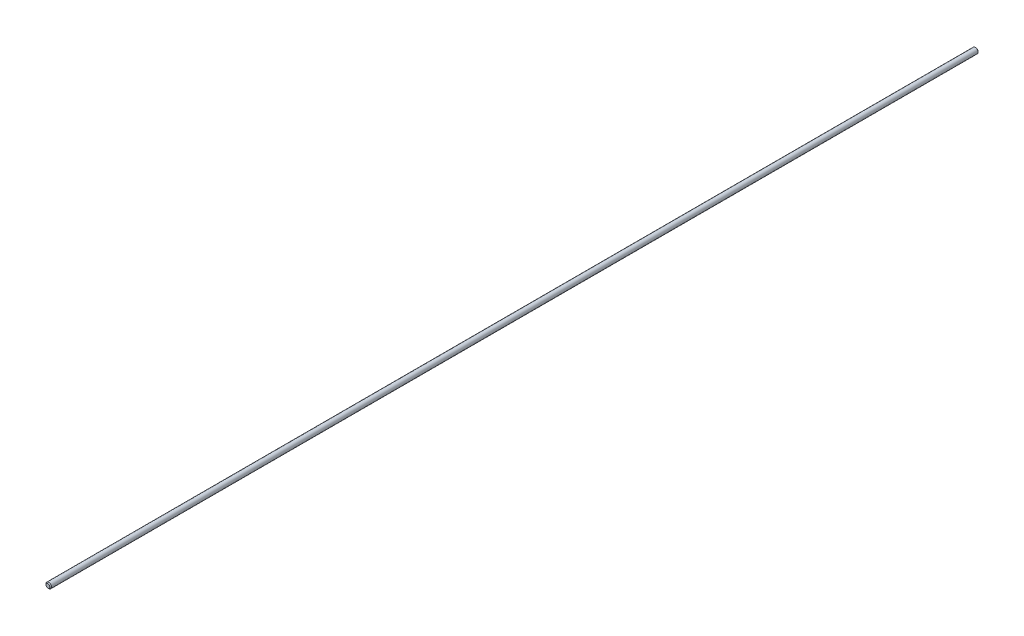
ISO-10303-21;
HEADER;
FILE_DESCRIPTION(('STEP AP214'),'2;1');
FILE_NAME('part.step','',(''),(''),'','','');
FILE_SCHEMA(('AUTOMOTIVE_DESIGN { 1 0 10303 214 1 1 1 1 }'));
ENDSEC;
DATA;
#1=APPLICATION_CONTEXT('core data for automotive mechanical design processes');
#2=APPLICATION_PROTOCOL_DEFINITION('international standard','automotive_design',2000,#1);
#3=PRODUCT_CONTEXT('',#1,'mechanical');
#4=PRODUCT('Part','Part','',(#3));
#5=PRODUCT_RELATED_PRODUCT_CATEGORY('part','',(#4));
#6=PRODUCT_DEFINITION_FORMATION('','',#4);
#7=PRODUCT_DEFINITION_CONTEXT('part definition',#1,'design');
#8=PRODUCT_DEFINITION('design','',#6,#7);
#9=PRODUCT_DEFINITION_SHAPE('','',#8);
#10=(LENGTH_UNIT() NAMED_UNIT(*) SI_UNIT(.MILLI.,.METRE.));
#11=(NAMED_UNIT(*) PLANE_ANGLE_UNIT() SI_UNIT($,.RADIAN.));
#12=(NAMED_UNIT(*) SI_UNIT($,.STERADIAN.) SOLID_ANGLE_UNIT());
#13=UNCERTAINTY_MEASURE_WITH_UNIT(LENGTH_MEASURE(1.E-05),#10,'distance_accuracy_value','');
#14=(GEOMETRIC_REPRESENTATION_CONTEXT(3) GLOBAL_UNCERTAINTY_ASSIGNED_CONTEXT((#13)) GLOBAL_UNIT_ASSIGNED_CONTEXT((#10,
#11,#12)) REPRESENTATION_CONTEXT('',''));
#15=CARTESIAN_POINT('',(0.,0.,0.));
#16=DIRECTION('',(0.,0.,1.));
#17=DIRECTION('',(1.,0.,0.));
#18=AXIS2_PLACEMENT_3D('',#15,#16,#17);
#19=CARTESIAN_POINT('',(0.,0.,267.3477));
#20=DIRECTION('',(0.,0.,1.));
#21=DIRECTION('',(1.,0.,0.));
#22=AXIS2_PLACEMENT_3D('',#19,#20,#21);
#23=CYLINDRICAL_SURFACE('',#22,1.58750000000226);
#24=CARTESIAN_POINT('',(0.,0.,-266.87145));
#25=DIRECTION('',(0.,0.,1.));
#26=DIRECTION('',(1.,0.,0.));
#27=AXIS2_PLACEMENT_3D('',#24,#25,#26);
#28=CIRCLE('',#27,1.58750000000226);
#29=CARTESIAN_POINT('',(1.58750000000226,0.,-266.87145));
#30=VERTEX_POINT('',#29);
#31=EDGE_CURVE('E42',#30,#30,#28,.T.);
#32=ORIENTED_EDGE('',*,*,#31,.T.);
#33=EDGE_LOOP('',(#32));
#34=FACE_BOUND('',#33,.T.);
#35=CARTESIAN_POINT('',(0.,0.,266.87145));
#36=DIRECTION('',(0.,0.,-1.));
#37=DIRECTION('',(-1.,0.,0.));
#38=AXIS2_PLACEMENT_3D('',#35,#36,#37);
#39=CIRCLE('',#38,1.58750000000226);
#40=CARTESIAN_POINT('',(-1.58750000000226,0.,266.87145));
#41=VERTEX_POINT('',#40);
#42=EDGE_CURVE('E46',#41,#41,#39,.T.);
#43=ORIENTED_EDGE('',*,*,#42,.T.);
#44=EDGE_LOOP('',(#43));
#45=FACE_BOUND('',#44,.T.);
#46=ADVANCED_FACE('F31',(#34,#45),#23,.T.);
#47=CARTESIAN_POINT('',(0.,1.58750000000226,-267.3477));
#48=DIRECTION('',(0.,0.,1.));
#49=DIRECTION('',(1.,0.,0.));
#50=AXIS2_PLACEMENT_3D('',#47,#48,#49);
#51=PLANE('',#50);
#52=CARTESIAN_POINT('',(0.,0.,-267.3477));
#53=DIRECTION('',(0.,0.,1.));
#54=DIRECTION('',(1.,0.,0.));
#55=AXIS2_PLACEMENT_3D('',#52,#53,#54);
#56=CIRCLE('',#55,1.11125000000223);
#57=CARTESIAN_POINT('',(1.11125000000223,0.,-267.3477));
#58=VERTEX_POINT('',#57);
#59=EDGE_CURVE('E38',#58,#58,#56,.F.);
#60=ORIENTED_EDGE('',*,*,#59,.T.);
#61=EDGE_LOOP('',(#60));
#62=FACE_BOUND('',#61,.T.);
#63=ADVANCED_FACE('F62',(#62),#51,.F.);
#64=CARTESIAN_POINT('',(0.,0.,267.3477));
#65=DIRECTION('',(0.,0.,-1.));
#66=DIRECTION('',(-1.,0.,0.));
#67=AXIS2_PLACEMENT_3D('',#64,#65,#66);
#68=PLANE('',#67);
#69=CARTESIAN_POINT('',(0.,0.,267.3477));
#70=DIRECTION('',(0.,0.,-1.));
#71=DIRECTION('',(-1.,0.,0.));
#72=AXIS2_PLACEMENT_3D('',#69,#70,#71);
#73=CIRCLE('',#72,1.11125000000223);
#74=CARTESIAN_POINT('',(-1.11125000000223,0.,267.3477));
#75=VERTEX_POINT('',#74);
#76=EDGE_CURVE('E10',#75,#75,#73,.F.);
#77=ORIENTED_EDGE('',*,*,#76,.T.);
#78=EDGE_LOOP('',(#77));
#79=FACE_BOUND('',#78,.T.);
#80=ADVANCED_FACE('F59',(#79),#68,.F.);
#81=CARTESIAN_POINT('',(0.,0.,-266.87145));
#82=DIRECTION('',(0.,0.,1.));
#83=DIRECTION('',(1.,0.,0.));
#84=AXIS2_PLACEMENT_3D('',#81,#82,#83);
#85=CONICAL_SURFACE('',#84,1.58750000000226,0.785398163397415);
#86=ORIENTED_EDGE('',*,*,#59,.F.);
#87=EDGE_LOOP('',(#86));
#88=FACE_BOUND('',#87,.T.);
#89=ORIENTED_EDGE('',*,*,#31,.F.);
#90=EDGE_LOOP('',(#89));
#91=FACE_BOUND('',#90,.T.);
#92=ADVANCED_FACE('F55',(#88,#91),#85,.T.);
#93=CARTESIAN_POINT('',(0.,0.,267.3477));
#94=DIRECTION('',(0.,0.,-1.));
#95=DIRECTION('',(-1.,0.,0.));
#96=AXIS2_PLACEMENT_3D('',#93,#94,#95);
#97=CONICAL_SURFACE('',#96,1.11125000000223,0.785398163397415);
#98=ORIENTED_EDGE('',*,*,#42,.F.);
#99=EDGE_LOOP('',(#98));
#100=FACE_BOUND('',#99,.T.);
#101=ORIENTED_EDGE('',*,*,#76,.F.);
#102=EDGE_LOOP('',(#101));
#103=FACE_BOUND('',#102,.T.);
#104=ADVANCED_FACE('F33',(#100,#103),#97,.T.);
#105=CLOSED_SHELL('',(#46,#63,#80,#92,#104));
#106=MANIFOLD_SOLID_BREP('B2',#105);
#107=ADVANCED_BREP_SHAPE_REPRESENTATION('',(#18,#106),#14);
#108=SHAPE_DEFINITION_REPRESENTATION(#9,#107);
ENDSEC;
END-ISO-10303-21;
